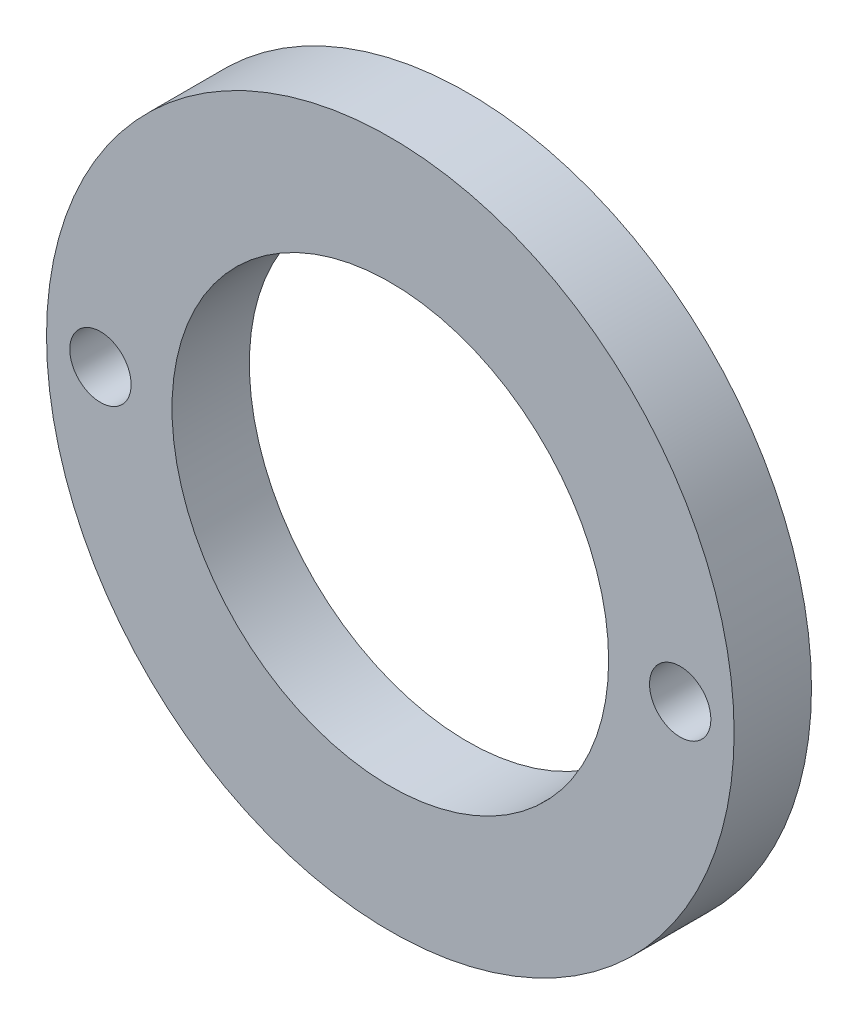
ISO-10303-21;
HEADER;
FILE_DESCRIPTION(('STEP AP214'),'2;1');
FILE_NAME('part.step','',(''),(''),'','','');
FILE_SCHEMA(('AUTOMOTIVE_DESIGN { 1 0 10303 214 1 1 1 1 }'));
ENDSEC;
DATA;
#1=APPLICATION_CONTEXT('core data for automotive mechanical design processes');
#2=APPLICATION_PROTOCOL_DEFINITION('international standard','automotive_design',2000,#1);
#3=PRODUCT_CONTEXT('',#1,'mechanical');
#4=PRODUCT('Part','Part','',(#3));
#5=PRODUCT_RELATED_PRODUCT_CATEGORY('part','',(#4));
#6=PRODUCT_DEFINITION_FORMATION('','',#4);
#7=PRODUCT_DEFINITION_CONTEXT('part definition',#1,'design');
#8=PRODUCT_DEFINITION('design','',#6,#7);
#9=PRODUCT_DEFINITION_SHAPE('','',#8);
#10=(LENGTH_UNIT() NAMED_UNIT(*) SI_UNIT(.MILLI.,.METRE.));
#11=(NAMED_UNIT(*) PLANE_ANGLE_UNIT() SI_UNIT($,.RADIAN.));
#12=(NAMED_UNIT(*) SI_UNIT($,.STERADIAN.) SOLID_ANGLE_UNIT());
#13=UNCERTAINTY_MEASURE_WITH_UNIT(LENGTH_MEASURE(1.E-05),#10,'distance_accuracy_value','');
#14=(GEOMETRIC_REPRESENTATION_CONTEXT(3) GLOBAL_UNCERTAINTY_ASSIGNED_CONTEXT((#13)) GLOBAL_UNIT_ASSIGNED_CONTEXT((#10,
#11,#12)) REPRESENTATION_CONTEXT('',''));
#15=CARTESIAN_POINT('',(0.,0.,0.));
#16=DIRECTION('',(0.,0.,1.));
#17=DIRECTION('',(1.,0.,0.));
#18=AXIS2_PLACEMENT_3D('',#15,#16,#17);
#19=CARTESIAN_POINT('',(0.,0.,4.5));
#20=DIRECTION('',(0.,0.,1.));
#21=DIRECTION('',(1.,0.,0.));
#22=AXIS2_PLACEMENT_3D('',#19,#20,#21);
#23=PLANE('',#22);
#24=CARTESIAN_POINT('',(-16.8627096143192,0.,4.5));
#25=DIRECTION('',(0.,0.,1.));
#26=DIRECTION('',(1.,0.,0.));
#27=AXIS2_PLACEMENT_3D('',#24,#25,#26);
#28=CIRCLE('',#27,1.78435);
#29=CARTESIAN_POINT('',(-15.0783596143192,0.,4.5));
#30=VERTEX_POINT('',#29);
#31=EDGE_CURVE('E64',#30,#30,#28,.T.);
#32=ORIENTED_EDGE('',*,*,#31,.F.);
#33=EDGE_LOOP('',(#32));
#34=FACE_BOUND('',#33,.T.);
#35=CARTESIAN_POINT('',(16.8627096143192,0.,4.5));
#36=DIRECTION('',(0.,0.,1.));
#37=DIRECTION('',(1.,0.,0.));
#38=AXIS2_PLACEMENT_3D('',#35,#36,#37);
#39=CIRCLE('',#38,1.78435);
#40=CARTESIAN_POINT('',(18.6470596143192,0.,4.5));
#41=VERTEX_POINT('',#40);
#42=EDGE_CURVE('E58',#41,#41,#39,.T.);
#43=ORIENTED_EDGE('',*,*,#42,.F.);
#44=EDGE_LOOP('',(#43));
#45=FACE_BOUND('',#44,.T.);
#46=CARTESIAN_POINT('',(0.,0.,4.5));
#47=DIRECTION('',(0.,0.,1.));
#48=DIRECTION('',(1.,0.,0.));
#49=AXIS2_PLACEMENT_3D('',#46,#47,#48);
#50=CIRCLE('',#49,20.);
#51=CARTESIAN_POINT('',(20.,0.,4.5));
#52=VERTEX_POINT('',#51);
#53=EDGE_CURVE('E11',#52,#52,#50,.T.);
#54=ORIENTED_EDGE('',*,*,#53,.T.);
#55=EDGE_LOOP('',(#54));
#56=FACE_BOUND('',#55,.T.);
#57=CARTESIAN_POINT('',(0.,0.,4.5));
#58=DIRECTION('',(0.,0.,1.));
#59=DIRECTION('',(1.,0.,0.));
#60=AXIS2_PLACEMENT_3D('',#57,#58,#59);
#61=CIRCLE('',#60,12.7);
#62=CARTESIAN_POINT('',(12.7,0.,4.5));
#63=VERTEX_POINT('',#62);
#64=EDGE_CURVE('E48',#63,#63,#61,.T.);
#65=ORIENTED_EDGE('',*,*,#64,.F.);
#66=EDGE_LOOP('',(#65));
#67=FACE_BOUND('',#66,.T.);
#68=ADVANCED_FACE('F37',(#34,#45,#56,#67),#23,.T.);
#69=CARTESIAN_POINT('',(0.,0.,0.));
#70=DIRECTION('',(0.,0.,1.));
#71=DIRECTION('',(1.,0.,0.));
#72=AXIS2_PLACEMENT_3D('',#69,#70,#71);
#73=PLANE('',#72);
#74=CARTESIAN_POINT('',(-16.8627096143192,0.,0.));
#75=DIRECTION('',(0.,0.,1.));
#76=DIRECTION('',(1.,0.,0.));
#77=AXIS2_PLACEMENT_3D('',#74,#75,#76);
#78=CIRCLE('',#77,1.78435);
#79=CARTESIAN_POINT('',(-15.0783596143192,0.,0.));
#80=VERTEX_POINT('',#79);
#81=EDGE_CURVE('E61',#80,#80,#78,.T.);
#82=ORIENTED_EDGE('',*,*,#81,.T.);
#83=EDGE_LOOP('',(#82));
#84=FACE_BOUND('',#83,.T.);
#85=CARTESIAN_POINT('',(16.8627096143192,0.,0.));
#86=DIRECTION('',(0.,0.,1.));
#87=DIRECTION('',(1.,0.,0.));
#88=AXIS2_PLACEMENT_3D('',#85,#86,#87);
#89=CIRCLE('',#88,1.78435);
#90=CARTESIAN_POINT('',(18.6470596143192,0.,0.));
#91=VERTEX_POINT('',#90);
#92=EDGE_CURVE('E53',#91,#91,#89,.T.);
#93=ORIENTED_EDGE('',*,*,#92,.T.);
#94=EDGE_LOOP('',(#93));
#95=FACE_BOUND('',#94,.T.);
#96=CARTESIAN_POINT('',(0.,0.,0.));
#97=DIRECTION('',(0.,0.,1.));
#98=DIRECTION('',(1.,0.,0.));
#99=AXIS2_PLACEMENT_3D('',#96,#97,#98);
#100=CIRCLE('',#99,20.);
#101=CARTESIAN_POINT('',(20.,0.,0.));
#102=VERTEX_POINT('',#101);
#103=EDGE_CURVE('E41',#102,#102,#100,.T.);
#104=ORIENTED_EDGE('',*,*,#103,.F.);
#105=EDGE_LOOP('',(#104));
#106=FACE_BOUND('',#105,.T.);
#107=CARTESIAN_POINT('',(0.,0.,0.));
#108=DIRECTION('',(0.,0.,1.));
#109=DIRECTION('',(1.,0.,0.));
#110=AXIS2_PLACEMENT_3D('',#107,#108,#109);
#111=CIRCLE('',#110,12.7);
#112=CARTESIAN_POINT('',(12.7,0.,0.));
#113=VERTEX_POINT('',#112);
#114=EDGE_CURVE('E50',#113,#113,#111,.T.);
#115=ORIENTED_EDGE('',*,*,#114,.T.);
#116=EDGE_LOOP('',(#115));
#117=FACE_BOUND('',#116,.T.);
#118=ADVANCED_FACE('F72',(#84,#95,#106,#117),#73,.F.);
#119=CARTESIAN_POINT('',(0.,0.,4.5));
#120=DIRECTION('',(0.,0.,-1.));
#121=DIRECTION('',(-1.,0.,0.));
#122=AXIS2_PLACEMENT_3D('',#119,#120,#121);
#123=CYLINDRICAL_SURFACE('',#122,20.);
#124=ORIENTED_EDGE('',*,*,#53,.F.);
#125=EDGE_LOOP('',(#124));
#126=FACE_BOUND('',#125,.T.);
#127=ORIENTED_EDGE('',*,*,#103,.T.);
#128=EDGE_LOOP('',(#127));
#129=FACE_BOUND('',#128,.T.);
#130=ADVANCED_FACE('F39',(#126,#129),#123,.T.);
#131=CARTESIAN_POINT('',(0.,0.,4.5));
#132=DIRECTION('',(0.,0.,-1.));
#133=DIRECTION('',(-1.,0.,0.));
#134=AXIS2_PLACEMENT_3D('',#131,#132,#133);
#135=CYLINDRICAL_SURFACE('',#134,12.7);
#136=ORIENTED_EDGE('',*,*,#64,.T.);
#137=EDGE_LOOP('',(#136));
#138=FACE_BOUND('',#137,.T.);
#139=ORIENTED_EDGE('',*,*,#114,.F.);
#140=EDGE_LOOP('',(#139));
#141=FACE_BOUND('',#140,.T.);
#142=ADVANCED_FACE('F78',(#138,#141),#135,.F.);
#143=CARTESIAN_POINT('',(16.8627096143192,0.,4.5));
#144=DIRECTION('',(0.,0.,1.));
#145=DIRECTION('',(1.,0.,0.));
#146=AXIS2_PLACEMENT_3D('',#143,#144,#145);
#147=CYLINDRICAL_SURFACE('',#146,1.78435);
#148=ORIENTED_EDGE('',*,*,#92,.F.);
#149=EDGE_LOOP('',(#148));
#150=FACE_BOUND('',#149,.T.);
#151=ORIENTED_EDGE('',*,*,#42,.T.);
#152=EDGE_LOOP('',(#151));
#153=FACE_BOUND('',#152,.T.);
#154=ADVANCED_FACE('F81',(#150,#153),#147,.F.);
#155=CARTESIAN_POINT('',(-16.8627096143192,0.,4.5));
#156=DIRECTION('',(0.,0.,1.));
#157=DIRECTION('',(1.,0.,0.));
#158=AXIS2_PLACEMENT_3D('',#155,#156,#157);
#159=CYLINDRICAL_SURFACE('',#158,1.78435);
#160=ORIENTED_EDGE('',*,*,#81,.F.);
#161=EDGE_LOOP('',(#160));
#162=FACE_BOUND('',#161,.T.);
#163=ORIENTED_EDGE('',*,*,#31,.T.);
#164=EDGE_LOOP('',(#163));
#165=FACE_BOUND('',#164,.T.);
#166=ADVANCED_FACE('F68',(#162,#165),#159,.F.);
#167=CLOSED_SHELL('',(#68,#118,#130,#142,#154,#166));
#168=MANIFOLD_SOLID_BREP('B2',#167);
#169=ADVANCED_BREP_SHAPE_REPRESENTATION('',(#18,#168),#14);
#170=SHAPE_DEFINITION_REPRESENTATION(#9,#169);
ENDSEC;
END-ISO-10303-21;
